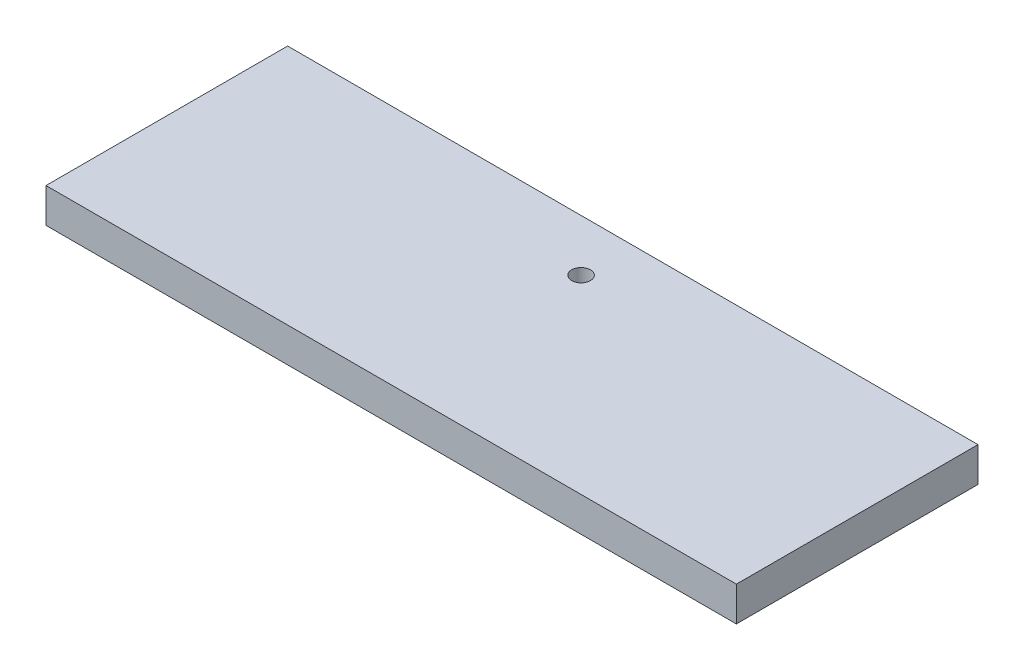
ISO-10303-21;
HEADER;
FILE_DESCRIPTION(('STEP AP214'),'2;1');
FILE_NAME('part.step','',(''),(''),'','','');
FILE_SCHEMA(('AUTOMOTIVE_DESIGN { 1 0 10303 214 1 1 1 1 }'));
ENDSEC;
DATA;
#1=APPLICATION_CONTEXT('core data for automotive mechanical design processes');
#2=APPLICATION_PROTOCOL_DEFINITION('international standard','automotive_design',2000,#1);
#3=PRODUCT_CONTEXT('',#1,'mechanical');
#4=PRODUCT('Part','Part','',(#3));
#5=PRODUCT_RELATED_PRODUCT_CATEGORY('part','',(#4));
#6=PRODUCT_DEFINITION_FORMATION('','',#4);
#7=PRODUCT_DEFINITION_CONTEXT('part definition',#1,'design');
#8=PRODUCT_DEFINITION('design','',#6,#7);
#9=PRODUCT_DEFINITION_SHAPE('','',#8);
#10=(LENGTH_UNIT() NAMED_UNIT(*) SI_UNIT(.MILLI.,.METRE.));
#11=(NAMED_UNIT(*) PLANE_ANGLE_UNIT() SI_UNIT($,.RADIAN.));
#12=(NAMED_UNIT(*) SI_UNIT($,.STERADIAN.) SOLID_ANGLE_UNIT());
#13=UNCERTAINTY_MEASURE_WITH_UNIT(LENGTH_MEASURE(1.E-05),#10,'distance_accuracy_value','');
#14=(GEOMETRIC_REPRESENTATION_CONTEXT(3) GLOBAL_UNCERTAINTY_ASSIGNED_CONTEXT((#13)) GLOBAL_UNIT_ASSIGNED_CONTEXT((#10,
#11,#12)) REPRESENTATION_CONTEXT('',''));
#15=CARTESIAN_POINT('',(0.,0.,0.));
#16=DIRECTION('',(0.,0.,1.));
#17=DIRECTION('',(1.,0.,0.));
#18=AXIS2_PLACEMENT_3D('',#15,#16,#17);
#19=CARTESIAN_POINT('',(63.5,6.35,22.225));
#20=DIRECTION('',(-1.,0.,0.));
#21=DIRECTION('',(0.,0.,1.));
#22=AXIS2_PLACEMENT_3D('',#19,#20,#21);
#23=PLANE('',#22);
#24=DIRECTION('',(0.,0.,-1.));
#25=VECTOR('',#24,1.);
#26=CARTESIAN_POINT('',(63.5,0.,22.225));
#27=LINE('',#26,#25);
#28=CARTESIAN_POINT('',(63.5,0.,22.225));
#29=VERTEX_POINT('',#28);
#30=CARTESIAN_POINT('',(63.5,0.,-22.225));
#31=VERTEX_POINT('',#30);
#32=EDGE_CURVE('E98',#29,#31,#27,.T.);
#33=ORIENTED_EDGE('',*,*,#32,.T.);
#34=DIRECTION('',(0.,-1.,0.));
#35=VECTOR('',#34,1.);
#36=CARTESIAN_POINT('',(63.5,6.35,-22.225));
#37=LINE('',#36,#35);
#38=CARTESIAN_POINT('',(63.5,6.35,-22.225));
#39=VERTEX_POINT('',#38);
#40=EDGE_CURVE('E11',#39,#31,#37,.T.);
#41=ORIENTED_EDGE('',*,*,#40,.F.);
#42=DIRECTION('',(0.,0.,-1.));
#43=VECTOR('',#42,1.);
#44=CARTESIAN_POINT('',(63.5,6.35,22.225));
#45=LINE('',#44,#43);
#46=CARTESIAN_POINT('',(63.5,6.35,22.225));
#47=VERTEX_POINT('',#46);
#48=EDGE_CURVE('E86',#47,#39,#45,.T.);
#49=ORIENTED_EDGE('',*,*,#48,.F.);
#50=DIRECTION('',(0.,-1.,0.));
#51=VECTOR('',#50,1.);
#52=CARTESIAN_POINT('',(63.5,6.35,22.225));
#53=LINE('',#52,#51);
#54=EDGE_CURVE('E94',#47,#29,#53,.T.);
#55=ORIENTED_EDGE('',*,*,#54,.T.);
#56=EDGE_LOOP('',(#33,#41,#49,#55));
#57=FACE_BOUND('',#56,.T.);
#58=ADVANCED_FACE('F35',(#57),#23,.F.);
#59=CARTESIAN_POINT('',(-63.5,6.35,-22.225));
#60=DIRECTION('',(0.,0.,1.));
#61=DIRECTION('',(1.,0.,0.));
#62=AXIS2_PLACEMENT_3D('',#59,#60,#61);
#63=PLANE('',#62);
#64=DIRECTION('',(-1.,0.,0.));
#65=VECTOR('',#64,1.);
#66=CARTESIAN_POINT('',(-63.5,0.,-22.225));
#67=LINE('',#66,#65);
#68=CARTESIAN_POINT('',(-63.5,0.,-22.225));
#69=VERTEX_POINT('',#68);
#70=EDGE_CURVE('E90',#31,#69,#67,.T.);
#71=ORIENTED_EDGE('',*,*,#70,.T.);
#72=DIRECTION('',(0.,-1.,0.));
#73=VECTOR('',#72,1.);
#74=CARTESIAN_POINT('',(-63.5,6.35,-22.225));
#75=LINE('',#74,#73);
#76=CARTESIAN_POINT('',(-63.5,6.35,-22.225));
#77=VERTEX_POINT('',#76);
#78=EDGE_CURVE('E43',#77,#69,#75,.T.);
#79=ORIENTED_EDGE('',*,*,#78,.F.);
#80=DIRECTION('',(-1.,0.,0.));
#81=VECTOR('',#80,1.);
#82=CARTESIAN_POINT('',(-63.5,6.35,-22.225));
#83=LINE('',#82,#81);
#84=EDGE_CURVE('E81',#39,#77,#83,.T.);
#85=ORIENTED_EDGE('',*,*,#84,.F.);
#86=ORIENTED_EDGE('',*,*,#40,.T.);
#87=EDGE_LOOP('',(#71,#79,#85,#86));
#88=FACE_BOUND('',#87,.T.);
#89=ADVANCED_FACE('F89',(#88),#63,.F.);
#90=CARTESIAN_POINT('',(-63.5,6.35,22.225));
#91=DIRECTION('',(1.,0.,0.));
#92=DIRECTION('',(0.,0.,-1.));
#93=AXIS2_PLACEMENT_3D('',#90,#91,#92);
#94=PLANE('',#93);
#95=DIRECTION('',(0.,0.,1.));
#96=VECTOR('',#95,1.);
#97=CARTESIAN_POINT('',(-63.5,0.,22.225));
#98=LINE('',#97,#96);
#99=CARTESIAN_POINT('',(-63.5,0.,22.225));
#100=VERTEX_POINT('',#99);
#101=EDGE_CURVE('E68',#69,#100,#98,.T.);
#102=ORIENTED_EDGE('',*,*,#101,.T.);
#103=DIRECTION('',(0.,-1.,0.));
#104=VECTOR('',#103,1.);
#105=CARTESIAN_POINT('',(-63.5,6.35,22.225));
#106=LINE('',#105,#104);
#107=CARTESIAN_POINT('',(-63.5,6.35,22.225));
#108=VERTEX_POINT('',#107);
#109=EDGE_CURVE('E91',#108,#100,#106,.T.);
#110=ORIENTED_EDGE('',*,*,#109,.F.);
#111=DIRECTION('',(0.,0.,1.));
#112=VECTOR('',#111,1.);
#113=CARTESIAN_POINT('',(-63.5,6.35,22.225));
#114=LINE('',#113,#112);
#115=EDGE_CURVE('E84',#77,#108,#114,.T.);
#116=ORIENTED_EDGE('',*,*,#115,.F.);
#117=ORIENTED_EDGE('',*,*,#78,.T.);
#118=EDGE_LOOP('',(#102,#110,#116,#117));
#119=FACE_BOUND('',#118,.T.);
#120=ADVANCED_FACE('F92',(#119),#94,.F.);
#121=CARTESIAN_POINT('',(-63.5,6.35,22.225));
#122=DIRECTION('',(0.,0.,-1.));
#123=DIRECTION('',(-1.,0.,0.));
#124=AXIS2_PLACEMENT_3D('',#121,#122,#123);
#125=PLANE('',#124);
#126=DIRECTION('',(1.,0.,0.));
#127=VECTOR('',#126,1.);
#128=CARTESIAN_POINT('',(-63.5,0.,22.225));
#129=LINE('',#128,#127);
#130=EDGE_CURVE('E74',#100,#29,#129,.T.);
#131=ORIENTED_EDGE('',*,*,#130,.T.);
#132=ORIENTED_EDGE('',*,*,#54,.F.);
#133=DIRECTION('',(1.,0.,0.));
#134=VECTOR('',#133,1.);
#135=CARTESIAN_POINT('',(-63.5,6.35,22.225));
#136=LINE('',#135,#134);
#137=EDGE_CURVE('E51',#108,#47,#136,.T.);
#138=ORIENTED_EDGE('',*,*,#137,.F.);
#139=ORIENTED_EDGE('',*,*,#109,.T.);
#140=EDGE_LOOP('',(#131,#132,#138,#139));
#141=FACE_BOUND('',#140,.T.);
#142=ADVANCED_FACE('F106',(#141),#125,.F.);
#143=CARTESIAN_POINT('',(0.,6.35,0.));
#144=DIRECTION('',(0.,-1.,0.));
#145=DIRECTION('',(0.,0.,-1.));
#146=AXIS2_PLACEMENT_3D('',#143,#144,#145);
#147=PLANE('',#146);
#148=CARTESIAN_POINT('',(0.,6.35,-12.7));
#149=DIRECTION('',(0.,1.,0.));
#150=DIRECTION('',(0.,0.,1.));
#151=AXIS2_PLACEMENT_3D('',#148,#149,#150);
#152=CIRCLE('',#151,1.72719999999999);
#153=CARTESIAN_POINT('',(0.,6.35,-10.9728));
#154=VERTEX_POINT('',#153);
#155=EDGE_CURVE('E114',#154,#154,#152,.T.);
#156=ORIENTED_EDGE('',*,*,#155,.F.);
#157=EDGE_LOOP('',(#156));
#158=FACE_BOUND('',#157,.T.);
#159=ORIENTED_EDGE('',*,*,#48,.T.);
#160=ORIENTED_EDGE('',*,*,#84,.T.);
#161=ORIENTED_EDGE('',*,*,#115,.T.);
#162=ORIENTED_EDGE('',*,*,#137,.T.);
#163=EDGE_LOOP('',(#159,#160,#161,#162));
#164=FACE_BOUND('',#163,.T.);
#165=ADVANCED_FACE('F82',(#158,#164),#147,.F.);
#166=CARTESIAN_POINT('',(0.,0.,0.));
#167=DIRECTION('',(0.,-1.,0.));
#168=DIRECTION('',(0.,0.,-1.));
#169=AXIS2_PLACEMENT_3D('',#166,#167,#168);
#170=PLANE('',#169);
#171=CARTESIAN_POINT('',(0.,0.,-12.7));
#172=DIRECTION('',(0.,-1.,0.));
#173=DIRECTION('',(0.,0.,-1.));
#174=AXIS2_PLACEMENT_3D('',#171,#172,#173);
#175=CIRCLE('',#174,1.72719999999999);
#176=CARTESIAN_POINT('',(0.,0.,-14.4272));
#177=VERTEX_POINT('',#176);
#178=EDGE_CURVE('E101',#177,#177,#175,.T.);
#179=ORIENTED_EDGE('',*,*,#178,.F.);
#180=EDGE_LOOP('',(#179));
#181=FACE_BOUND('',#180,.T.);
#182=ORIENTED_EDGE('',*,*,#32,.F.);
#183=ORIENTED_EDGE('',*,*,#130,.F.);
#184=ORIENTED_EDGE('',*,*,#101,.F.);
#185=ORIENTED_EDGE('',*,*,#70,.F.);
#186=EDGE_LOOP('',(#182,#183,#184,#185));
#187=FACE_BOUND('',#186,.T.);
#188=ADVANCED_FACE('F109',(#181,#187),#170,.T.);
#189=CARTESIAN_POINT('',(0.,6.35,-12.7));
#190=DIRECTION('',(0.,1.,0.));
#191=DIRECTION('',(0.,0.,1.));
#192=AXIS2_PLACEMENT_3D('',#189,#190,#191);
#193=CYLINDRICAL_SURFACE('',#192,1.72719999999999);
#194=ORIENTED_EDGE('',*,*,#178,.T.);
#195=EDGE_LOOP('',(#194));
#196=FACE_BOUND('',#195,.T.);
#197=ORIENTED_EDGE('',*,*,#155,.T.);
#198=EDGE_LOOP('',(#197));
#199=FACE_BOUND('',#198,.T.);
#200=ADVANCED_FACE('F118',(#196,#199),#193,.F.);
#201=CLOSED_SHELL('',(#58,#89,#120,#142,#165,#188,#200));
#202=MANIFOLD_SOLID_BREP('B2',#201);
#203=ADVANCED_BREP_SHAPE_REPRESENTATION('',(#18,#202),#14);
#204=SHAPE_DEFINITION_REPRESENTATION(#9,#203);
ENDSEC;
END-ISO-10303-21;
